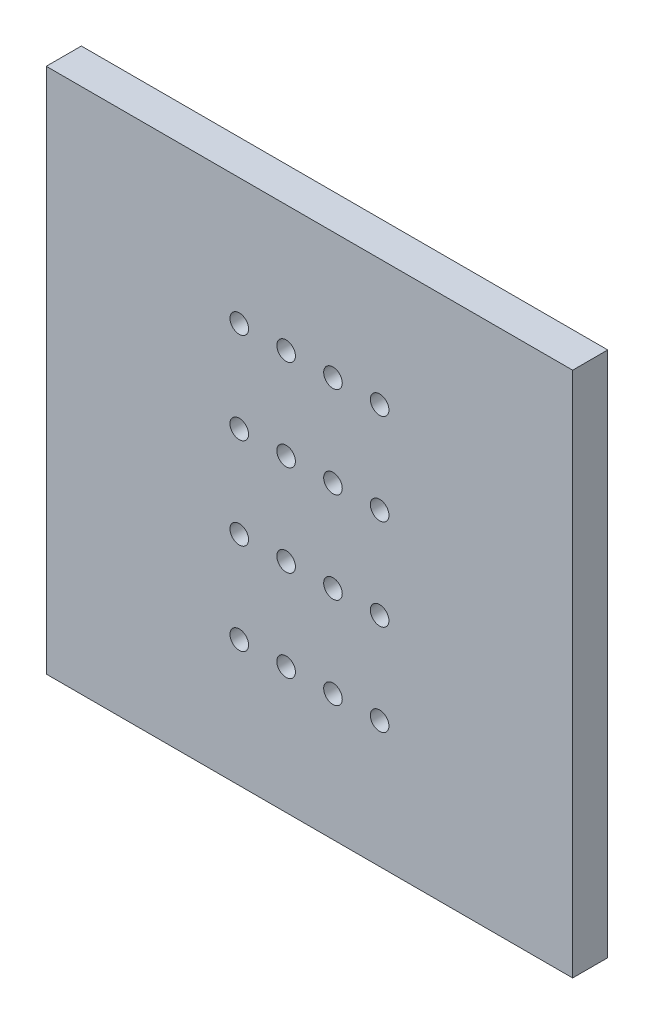
ISO-10303-21;
HEADER;
FILE_DESCRIPTION(('STEP AP214'),'2;1');
FILE_NAME('part.step','',(''),(''),'','','');
FILE_SCHEMA(('AUTOMOTIVE_DESIGN { 1 0 10303 214 1 1 1 1 }'));
ENDSEC;
DATA;
#1=APPLICATION_CONTEXT('core data for automotive mechanical design processes');
#2=APPLICATION_PROTOCOL_DEFINITION('international standard','automotive_design',2000,#1);
#3=PRODUCT_CONTEXT('',#1,'mechanical');
#4=PRODUCT('Part','Part','',(#3));
#5=PRODUCT_RELATED_PRODUCT_CATEGORY('part','',(#4));
#6=PRODUCT_DEFINITION_FORMATION('','',#4);
#7=PRODUCT_DEFINITION_CONTEXT('part definition',#1,'design');
#8=PRODUCT_DEFINITION('design','',#6,#7);
#9=PRODUCT_DEFINITION_SHAPE('','',#8);
#10=(LENGTH_UNIT() NAMED_UNIT(*) SI_UNIT(.MILLI.,.METRE.));
#11=(NAMED_UNIT(*) PLANE_ANGLE_UNIT() SI_UNIT($,.RADIAN.));
#12=(NAMED_UNIT(*) SI_UNIT($,.STERADIAN.) SOLID_ANGLE_UNIT());
#13=UNCERTAINTY_MEASURE_WITH_UNIT(LENGTH_MEASURE(1.E-05),#10,'distance_accuracy_value','');
#14=(GEOMETRIC_REPRESENTATION_CONTEXT(3) GLOBAL_UNCERTAINTY_ASSIGNED_CONTEXT((#13)) GLOBAL_UNIT_ASSIGNED_CONTEXT((#10,
#11,#12)) REPRESENTATION_CONTEXT('',''));
#15=CARTESIAN_POINT('',(0.,0.,0.));
#16=DIRECTION('',(0.,0.,1.));
#17=DIRECTION('',(1.,0.,0.));
#18=AXIS2_PLACEMENT_3D('',#15,#16,#17);
#19=CARTESIAN_POINT('',(15.,-15.,2.));
#20=DIRECTION('',(-1.,0.,0.));
#21=DIRECTION('',(0.,0.,1.));
#22=AXIS2_PLACEMENT_3D('',#19,#20,#21);
#23=PLANE('',#22);
#24=DIRECTION('',(0.,1.,0.));
#25=VECTOR('',#24,1.);
#26=CARTESIAN_POINT('',(15.,-15.,0.));
#27=LINE('',#26,#25);
#28=CARTESIAN_POINT('',(15.,-15.,0.));
#29=VERTEX_POINT('',#28);
#30=CARTESIAN_POINT('',(15.,15.,0.));
#31=VERTEX_POINT('',#30);
#32=EDGE_CURVE('E103',#29,#31,#27,.T.);
#33=ORIENTED_EDGE('',*,*,#32,.T.);
#34=DIRECTION('',(0.,0.,-1.));
#35=VECTOR('',#34,1.);
#36=CARTESIAN_POINT('',(15.,15.,2.));
#37=LINE('',#36,#35);
#38=CARTESIAN_POINT('',(15.,15.,2.));
#39=VERTEX_POINT('',#38);
#40=EDGE_CURVE('E11',#39,#31,#37,.T.);
#41=ORIENTED_EDGE('',*,*,#40,.F.);
#42=DIRECTION('',(0.,1.,0.));
#43=VECTOR('',#42,1.);
#44=CARTESIAN_POINT('',(15.,-15.,2.));
#45=LINE('',#44,#43);
#46=CARTESIAN_POINT('',(15.,-15.,2.));
#47=VERTEX_POINT('',#46);
#48=EDGE_CURVE('E90',#47,#39,#45,.T.);
#49=ORIENTED_EDGE('',*,*,#48,.F.);
#50=DIRECTION('',(0.,0.,-1.));
#51=VECTOR('',#50,1.);
#52=CARTESIAN_POINT('',(15.,-15.,2.));
#53=LINE('',#52,#51);
#54=EDGE_CURVE('E99',#47,#29,#53,.T.);
#55=ORIENTED_EDGE('',*,*,#54,.T.);
#56=EDGE_LOOP('',(#33,#41,#49,#55));
#57=FACE_BOUND('',#56,.T.);
#58=ADVANCED_FACE('F37',(#57),#23,.F.);
#59=CARTESIAN_POINT('',(-15.,15.,2.));
#60=DIRECTION('',(0.,-1.,0.));
#61=DIRECTION('',(0.,0.,-1.));
#62=AXIS2_PLACEMENT_3D('',#59,#60,#61);
#63=PLANE('',#62);
#64=DIRECTION('',(-1.,0.,0.));
#65=VECTOR('',#64,1.);
#66=CARTESIAN_POINT('',(-15.,15.,0.));
#67=LINE('',#66,#65);
#68=CARTESIAN_POINT('',(-15.,15.,0.));
#69=VERTEX_POINT('',#68);
#70=EDGE_CURVE('E94',#31,#69,#67,.T.);
#71=ORIENTED_EDGE('',*,*,#70,.T.);
#72=DIRECTION('',(0.,0.,-1.));
#73=VECTOR('',#72,1.);
#74=CARTESIAN_POINT('',(-15.,15.,2.));
#75=LINE('',#74,#73);
#76=CARTESIAN_POINT('',(-15.,15.,2.));
#77=VERTEX_POINT('',#76);
#78=EDGE_CURVE('E46',#77,#69,#75,.T.);
#79=ORIENTED_EDGE('',*,*,#78,.F.);
#80=DIRECTION('',(-1.,0.,0.));
#81=VECTOR('',#80,1.);
#82=CARTESIAN_POINT('',(-15.,15.,2.));
#83=LINE('',#82,#81);
#84=EDGE_CURVE('E85',#39,#77,#83,.T.);
#85=ORIENTED_EDGE('',*,*,#84,.F.);
#86=ORIENTED_EDGE('',*,*,#40,.T.);
#87=EDGE_LOOP('',(#71,#79,#85,#86));
#88=FACE_BOUND('',#87,.T.);
#89=ADVANCED_FACE('F93',(#88),#63,.F.);
#90=CARTESIAN_POINT('',(-15.,-15.,2.));
#91=DIRECTION('',(1.,0.,0.));
#92=DIRECTION('',(0.,0.,-1.));
#93=AXIS2_PLACEMENT_3D('',#90,#91,#92);
#94=PLANE('',#93);
#95=DIRECTION('',(0.,-1.,0.));
#96=VECTOR('',#95,1.);
#97=CARTESIAN_POINT('',(-15.,-15.,0.));
#98=LINE('',#97,#96);
#99=CARTESIAN_POINT('',(-15.,-15.,0.));
#100=VERTEX_POINT('',#99);
#101=EDGE_CURVE('E72',#69,#100,#98,.T.);
#102=ORIENTED_EDGE('',*,*,#101,.T.);
#103=DIRECTION('',(0.,0.,-1.));
#104=VECTOR('',#103,1.);
#105=CARTESIAN_POINT('',(-15.,-15.,2.));
#106=LINE('',#105,#104);
#107=CARTESIAN_POINT('',(-15.,-15.,2.));
#108=VERTEX_POINT('',#107);
#109=EDGE_CURVE('E95',#108,#100,#106,.T.);
#110=ORIENTED_EDGE('',*,*,#109,.F.);
#111=DIRECTION('',(0.,-1.,0.));
#112=VECTOR('',#111,1.);
#113=CARTESIAN_POINT('',(-15.,-15.,2.));
#114=LINE('',#113,#112);
#115=EDGE_CURVE('E88',#77,#108,#114,.T.);
#116=ORIENTED_EDGE('',*,*,#115,.F.);
#117=ORIENTED_EDGE('',*,*,#78,.T.);
#118=EDGE_LOOP('',(#102,#110,#116,#117));
#119=FACE_BOUND('',#118,.T.);
#120=ADVANCED_FACE('F97',(#119),#94,.F.);
#121=CARTESIAN_POINT('',(-15.,-15.,2.));
#122=DIRECTION('',(0.,1.,0.));
#123=DIRECTION('',(0.,0.,1.));
#124=AXIS2_PLACEMENT_3D('',#121,#122,#123);
#125=PLANE('',#124);
#126=DIRECTION('',(1.,0.,0.));
#127=VECTOR('',#126,1.);
#128=CARTESIAN_POINT('',(-15.,-15.,0.));
#129=LINE('',#128,#127);
#130=EDGE_CURVE('E78',#100,#29,#129,.T.);
#131=ORIENTED_EDGE('',*,*,#130,.T.);
#132=ORIENTED_EDGE('',*,*,#54,.F.);
#133=DIRECTION('',(1.,0.,0.));
#134=VECTOR('',#133,1.);
#135=CARTESIAN_POINT('',(-15.,-15.,2.));
#136=LINE('',#135,#134);
#137=EDGE_CURVE('E55',#108,#47,#136,.T.);
#138=ORIENTED_EDGE('',*,*,#137,.F.);
#139=ORIENTED_EDGE('',*,*,#109,.T.);
#140=EDGE_LOOP('',(#131,#132,#138,#139));
#141=FACE_BOUND('',#140,.T.);
#142=ADVANCED_FACE('F199',(#141),#125,.F.);
#143=CARTESIAN_POINT('',(0.,0.,2.));
#144=DIRECTION('',(0.,0.,-1.));
#145=DIRECTION('',(-1.,0.,0.));
#146=AXIS2_PLACEMENT_3D('',#143,#144,#145);
#147=PLANE('',#146);
#148=CARTESIAN_POINT('',(-1.33,-2.6,2.));
#149=DIRECTION('',(0.,0.,1.));
#150=DIRECTION('',(1.,0.,0.));
#151=AXIS2_PLACEMENT_3D('',#148,#149,#150);
#152=CIRCLE('',#151,0.53);
#153=CARTESIAN_POINT('',(-0.8,-2.6,2.));
#154=VERTEX_POINT('',#153);
#155=EDGE_CURVE('E450',#154,#154,#152,.T.);
#156=ORIENTED_EDGE('',*,*,#155,.F.);
#157=EDGE_LOOP('',(#156));
#158=FACE_BOUND('',#157,.T.);
#159=CARTESIAN_POINT('',(-1.33,2.6,2.));
#160=DIRECTION('',(0.,0.,1.));
#161=DIRECTION('',(1.,0.,0.));
#162=AXIS2_PLACEMENT_3D('',#159,#160,#161);
#163=CIRCLE('',#162,0.53);
#164=CARTESIAN_POINT('',(-0.8,2.6,2.));
#165=VERTEX_POINT('',#164);
#166=EDGE_CURVE('E448',#165,#165,#163,.T.);
#167=ORIENTED_EDGE('',*,*,#166,.F.);
#168=EDGE_LOOP('',(#167));
#169=FACE_BOUND('',#168,.T.);
#170=CARTESIAN_POINT('',(-1.33,7.8,2.));
#171=DIRECTION('',(0.,0.,1.));
#172=DIRECTION('',(1.,0.,0.));
#173=AXIS2_PLACEMENT_3D('',#170,#171,#172);
#174=CIRCLE('',#173,0.53);
#175=CARTESIAN_POINT('',(-0.8,7.8,2.));
#176=VERTEX_POINT('',#175);
#177=EDGE_CURVE('E451',#176,#176,#174,.T.);
#178=ORIENTED_EDGE('',*,*,#177,.F.);
#179=EDGE_LOOP('',(#178));
#180=FACE_BOUND('',#179,.T.);
#181=CARTESIAN_POINT('',(1.34,-7.8,2.));
#182=DIRECTION('',(0.,0.,1.));
#183=DIRECTION('',(1.,0.,0.));
#184=AXIS2_PLACEMENT_3D('',#181,#182,#183);
#185=CIRCLE('',#184,0.53);
#186=CARTESIAN_POINT('',(1.87,-7.8,2.));
#187=VERTEX_POINT('',#186);
#188=EDGE_CURVE('E457',#187,#187,#185,.T.);
#189=ORIENTED_EDGE('',*,*,#188,.F.);
#190=EDGE_LOOP('',(#189));
#191=FACE_BOUND('',#190,.T.);
#192=CARTESIAN_POINT('',(-4.,-2.6,2.));
#193=DIRECTION('',(0.,0.,1.));
#194=DIRECTION('',(1.,0.,0.));
#195=AXIS2_PLACEMENT_3D('',#192,#193,#194);
#196=CIRCLE('',#195,0.53);
#197=CARTESIAN_POINT('',(-3.47,-2.6,2.));
#198=VERTEX_POINT('',#197);
#199=EDGE_CURVE('E467',#198,#198,#196,.T.);
#200=ORIENTED_EDGE('',*,*,#199,.F.);
#201=EDGE_LOOP('',(#200));
#202=FACE_BOUND('',#201,.T.);
#203=CARTESIAN_POINT('',(-4.,2.6,2.));
#204=DIRECTION('',(0.,0.,1.));
#205=DIRECTION('',(1.,0.,0.));
#206=AXIS2_PLACEMENT_3D('',#203,#204,#205);
#207=CIRCLE('',#206,0.53);
#208=CARTESIAN_POINT('',(-3.47,2.6,2.));
#209=VERTEX_POINT('',#208);
#210=EDGE_CURVE('E464',#209,#209,#207,.T.);
#211=ORIENTED_EDGE('',*,*,#210,.F.);
#212=EDGE_LOOP('',(#211));
#213=FACE_BOUND('',#212,.T.);
#214=CARTESIAN_POINT('',(-4.,7.8,2.));
#215=DIRECTION('',(0.,0.,1.));
#216=DIRECTION('',(1.,0.,0.));
#217=AXIS2_PLACEMENT_3D('',#214,#215,#216);
#218=CIRCLE('',#217,0.53);
#219=CARTESIAN_POINT('',(-3.47,7.8,2.));
#220=VERTEX_POINT('',#219);
#221=EDGE_CURVE('E461',#220,#220,#218,.T.);
#222=ORIENTED_EDGE('',*,*,#221,.F.);
#223=EDGE_LOOP('',(#222));
#224=FACE_BOUND('',#223,.T.);
#225=CARTESIAN_POINT('',(-1.33,-7.8,2.));
#226=DIRECTION('',(0.,0.,1.));
#227=DIRECTION('',(1.,0.,0.));
#228=AXIS2_PLACEMENT_3D('',#225,#226,#227);
#229=CIRCLE('',#228,0.53);
#230=CARTESIAN_POINT('',(-0.8,-7.8,2.));
#231=VERTEX_POINT('',#230);
#232=EDGE_CURVE('E454',#231,#231,#229,.T.);
#233=ORIENTED_EDGE('',*,*,#232,.F.);
#234=EDGE_LOOP('',(#233));
#235=FACE_BOUND('',#234,.T.);
#236=CARTESIAN_POINT('',(4.,7.8,2.));
#237=DIRECTION('',(0.,0.,1.));
#238=DIRECTION('',(1.,0.,0.));
#239=AXIS2_PLACEMENT_3D('',#236,#237,#238);
#240=CIRCLE('',#239,0.53);
#241=CARTESIAN_POINT('',(4.53,7.8,2.));
#242=VERTEX_POINT('',#241);
#243=EDGE_CURVE('E487',#242,#242,#240,.T.);
#244=ORIENTED_EDGE('',*,*,#243,.F.);
#245=EDGE_LOOP('',(#244));
#246=FACE_BOUND('',#245,.T.);
#247=CARTESIAN_POINT('',(4.,2.6,2.));
#248=DIRECTION('',(0.,0.,1.));
#249=DIRECTION('',(1.,0.,0.));
#250=AXIS2_PLACEMENT_3D('',#247,#248,#249);
#251=CIRCLE('',#250,0.53);
#252=CARTESIAN_POINT('',(4.53,2.6,2.));
#253=VERTEX_POINT('',#252);
#254=EDGE_CURVE('E491',#253,#253,#251,.T.);
#255=ORIENTED_EDGE('',*,*,#254,.F.);
#256=EDGE_LOOP('',(#255));
#257=FACE_BOUND('',#256,.T.);
#258=CARTESIAN_POINT('',(4.,-2.6,2.));
#259=DIRECTION('',(0.,0.,1.));
#260=DIRECTION('',(1.,0.,0.));
#261=AXIS2_PLACEMENT_3D('',#258,#259,#260);
#262=CIRCLE('',#261,0.53);
#263=CARTESIAN_POINT('',(4.53,-2.6,2.));
#264=VERTEX_POINT('',#263);
#265=EDGE_CURVE('E495',#264,#264,#262,.T.);
#266=ORIENTED_EDGE('',*,*,#265,.F.);
#267=EDGE_LOOP('',(#266));
#268=FACE_BOUND('',#267,.T.);
#269=CARTESIAN_POINT('',(1.34,-2.6,2.));
#270=DIRECTION('',(0.,0.,1.));
#271=DIRECTION('',(1.,0.,0.));
#272=AXIS2_PLACEMENT_3D('',#269,#270,#271);
#273=CIRCLE('',#272,0.53);
#274=CARTESIAN_POINT('',(1.87,-2.6,2.));
#275=VERTEX_POINT('',#274);
#276=EDGE_CURVE('E499',#275,#275,#273,.T.);
#277=ORIENTED_EDGE('',*,*,#276,.F.);
#278=EDGE_LOOP('',(#277));
#279=FACE_BOUND('',#278,.T.);
#280=CARTESIAN_POINT('',(1.34,2.6,2.));
#281=DIRECTION('',(0.,0.,1.));
#282=DIRECTION('',(1.,0.,0.));
#283=AXIS2_PLACEMENT_3D('',#280,#281,#282);
#284=CIRCLE('',#283,0.53);
#285=CARTESIAN_POINT('',(1.87,2.6,2.));
#286=VERTEX_POINT('',#285);
#287=EDGE_CURVE('E503',#286,#286,#284,.T.);
#288=ORIENTED_EDGE('',*,*,#287,.F.);
#289=EDGE_LOOP('',(#288));
#290=FACE_BOUND('',#289,.T.);
#291=CARTESIAN_POINT('',(1.34,7.8,2.));
#292=DIRECTION('',(0.,0.,1.));
#293=DIRECTION('',(1.,0.,0.));
#294=AXIS2_PLACEMENT_3D('',#291,#292,#293);
#295=CIRCLE('',#294,0.53);
#296=CARTESIAN_POINT('',(1.87,7.8,2.));
#297=VERTEX_POINT('',#296);
#298=EDGE_CURVE('E507',#297,#297,#295,.T.);
#299=ORIENTED_EDGE('',*,*,#298,.F.);
#300=EDGE_LOOP('',(#299));
#301=FACE_BOUND('',#300,.T.);
#302=CARTESIAN_POINT('',(4.,-7.8,2.));
#303=DIRECTION('',(0.,0.,1.));
#304=DIRECTION('',(1.,0.,0.));
#305=AXIS2_PLACEMENT_3D('',#302,#303,#304);
#306=CIRCLE('',#305,0.53);
#307=CARTESIAN_POINT('',(4.53,-7.8,2.));
#308=VERTEX_POINT('',#307);
#309=EDGE_CURVE('E510',#308,#308,#306,.T.);
#310=ORIENTED_EDGE('',*,*,#309,.F.);
#311=EDGE_LOOP('',(#310));
#312=FACE_BOUND('',#311,.T.);
#313=CARTESIAN_POINT('',(-4.,-7.8,2.));
#314=DIRECTION('',(0.,0.,1.));
#315=DIRECTION('',(1.,0.,0.));
#316=AXIS2_PLACEMENT_3D('',#313,#314,#315);
#317=CIRCLE('',#316,0.53);
#318=CARTESIAN_POINT('',(-3.47,-7.8,2.));
#319=VERTEX_POINT('',#318);
#320=EDGE_CURVE('E115',#319,#319,#317,.T.);
#321=ORIENTED_EDGE('',*,*,#320,.F.);
#322=EDGE_LOOP('',(#321));
#323=FACE_BOUND('',#322,.T.);
#324=ORIENTED_EDGE('',*,*,#48,.T.);
#325=ORIENTED_EDGE('',*,*,#84,.T.);
#326=ORIENTED_EDGE('',*,*,#115,.T.);
#327=ORIENTED_EDGE('',*,*,#137,.T.);
#328=EDGE_LOOP('',(#324,#325,#326,#327));
#329=FACE_BOUND('',#328,.T.);
#330=ADVANCED_FACE('F86',(#158,#169,#180,#191,#202,#213,#224,#235,#246,#257,#268,#279,#290,#301,
#312,#323,#329),#147,.F.);
#331=CARTESIAN_POINT('',(0.,0.,0.));
#332=DIRECTION('',(0.,0.,-1.));
#333=DIRECTION('',(-1.,0.,0.));
#334=AXIS2_PLACEMENT_3D('',#331,#332,#333);
#335=PLANE('',#334);
#336=CARTESIAN_POINT('',(-1.33,-2.6,0.));
#337=DIRECTION('',(0.,0.,-1.));
#338=DIRECTION('',(-1.,0.,0.));
#339=AXIS2_PLACEMENT_3D('',#336,#337,#338);
#340=CIRCLE('',#339,0.53);
#341=CARTESIAN_POINT('',(-1.86,-2.6,0.));
#342=VERTEX_POINT('',#341);
#343=EDGE_CURVE('E40',#342,#342,#340,.T.);
#344=ORIENTED_EDGE('',*,*,#343,.F.);
#345=EDGE_LOOP('',(#344));
#346=FACE_BOUND('',#345,.T.);
#347=CARTESIAN_POINT('',(-1.33,2.6,0.));
#348=DIRECTION('',(0.,0.,-1.));
#349=DIRECTION('',(-1.,0.,0.));
#350=AXIS2_PLACEMENT_3D('',#347,#348,#349);
#351=CIRCLE('',#350,0.53);
#352=CARTESIAN_POINT('',(-1.86,2.6,0.));
#353=VERTEX_POINT('',#352);
#354=EDGE_CURVE('E153',#353,#353,#351,.T.);
#355=ORIENTED_EDGE('',*,*,#354,.F.);
#356=EDGE_LOOP('',(#355));
#357=FACE_BOUND('',#356,.T.);
#358=CARTESIAN_POINT('',(-1.33,7.8,0.));
#359=DIRECTION('',(0.,0.,-1.));
#360=DIRECTION('',(-1.,0.,0.));
#361=AXIS2_PLACEMENT_3D('',#358,#359,#360);
#362=CIRCLE('',#361,0.53);
#363=CARTESIAN_POINT('',(-1.86,7.8,0.));
#364=VERTEX_POINT('',#363);
#365=EDGE_CURVE('E151',#364,#364,#362,.T.);
#366=ORIENTED_EDGE('',*,*,#365,.F.);
#367=EDGE_LOOP('',(#366));
#368=FACE_BOUND('',#367,.T.);
#369=CARTESIAN_POINT('',(1.34,-7.8,0.));
#370=DIRECTION('',(0.,0.,-1.));
#371=DIRECTION('',(-1.,0.,0.));
#372=AXIS2_PLACEMENT_3D('',#369,#370,#371);
#373=CIRCLE('',#372,0.53);
#374=CARTESIAN_POINT('',(0.81,-7.8,0.));
#375=VERTEX_POINT('',#374);
#376=EDGE_CURVE('E148',#375,#375,#373,.T.);
#377=ORIENTED_EDGE('',*,*,#376,.F.);
#378=EDGE_LOOP('',(#377));
#379=FACE_BOUND('',#378,.T.);
#380=CARTESIAN_POINT('',(-4.,-2.6,0.));
#381=DIRECTION('',(0.,0.,-1.));
#382=DIRECTION('',(-1.,0.,0.));
#383=AXIS2_PLACEMENT_3D('',#380,#381,#382);
#384=CIRCLE('',#383,0.53);
#385=CARTESIAN_POINT('',(-4.53,-2.6,0.));
#386=VERTEX_POINT('',#385);
#387=EDGE_CURVE('E145',#386,#386,#384,.T.);
#388=ORIENTED_EDGE('',*,*,#387,.F.);
#389=EDGE_LOOP('',(#388));
#390=FACE_BOUND('',#389,.T.);
#391=CARTESIAN_POINT('',(-4.,2.6,0.));
#392=DIRECTION('',(0.,0.,-1.));
#393=DIRECTION('',(-1.,0.,0.));
#394=AXIS2_PLACEMENT_3D('',#391,#392,#393);
#395=CIRCLE('',#394,0.53);
#396=CARTESIAN_POINT('',(-4.53,2.6,0.));
#397=VERTEX_POINT('',#396);
#398=EDGE_CURVE('E142',#397,#397,#395,.T.);
#399=ORIENTED_EDGE('',*,*,#398,.F.);
#400=EDGE_LOOP('',(#399));
#401=FACE_BOUND('',#400,.T.);
#402=CARTESIAN_POINT('',(-4.,7.8,0.));
#403=DIRECTION('',(0.,0.,-1.));
#404=DIRECTION('',(-1.,0.,0.));
#405=AXIS2_PLACEMENT_3D('',#402,#403,#404);
#406=CIRCLE('',#405,0.53);
#407=CARTESIAN_POINT('',(-4.53,7.8,0.));
#408=VERTEX_POINT('',#407);
#409=EDGE_CURVE('E139',#408,#408,#406,.T.);
#410=ORIENTED_EDGE('',*,*,#409,.F.);
#411=EDGE_LOOP('',(#410));
#412=FACE_BOUND('',#411,.T.);
#413=CARTESIAN_POINT('',(-1.33,-7.8,0.));
#414=DIRECTION('',(0.,0.,-1.));
#415=DIRECTION('',(-1.,0.,0.));
#416=AXIS2_PLACEMENT_3D('',#413,#414,#415);
#417=CIRCLE('',#416,0.53);
#418=CARTESIAN_POINT('',(-1.86,-7.8,0.));
#419=VERTEX_POINT('',#418);
#420=EDGE_CURVE('E136',#419,#419,#417,.T.);
#421=ORIENTED_EDGE('',*,*,#420,.F.);
#422=EDGE_LOOP('',(#421));
#423=FACE_BOUND('',#422,.T.);
#424=CARTESIAN_POINT('',(4.,7.8,0.));
#425=DIRECTION('',(0.,0.,-1.));
#426=DIRECTION('',(-1.,0.,0.));
#427=AXIS2_PLACEMENT_3D('',#424,#425,#426);
#428=CIRCLE('',#427,0.53);
#429=CARTESIAN_POINT('',(3.47,7.8,0.));
#430=VERTEX_POINT('',#429);
#431=EDGE_CURVE('E133',#430,#430,#428,.T.);
#432=ORIENTED_EDGE('',*,*,#431,.F.);
#433=EDGE_LOOP('',(#432));
#434=FACE_BOUND('',#433,.T.);
#435=CARTESIAN_POINT('',(4.,2.6,0.));
#436=DIRECTION('',(0.,0.,-1.));
#437=DIRECTION('',(-1.,0.,0.));
#438=AXIS2_PLACEMENT_3D('',#435,#436,#437);
#439=CIRCLE('',#438,0.53);
#440=CARTESIAN_POINT('',(3.47,2.6,0.));
#441=VERTEX_POINT('',#440);
#442=EDGE_CURVE('E130',#441,#441,#439,.T.);
#443=ORIENTED_EDGE('',*,*,#442,.F.);
#444=EDGE_LOOP('',(#443));
#445=FACE_BOUND('',#444,.T.);
#446=CARTESIAN_POINT('',(4.,-2.6,0.));
#447=DIRECTION('',(0.,0.,-1.));
#448=DIRECTION('',(-1.,0.,0.));
#449=AXIS2_PLACEMENT_3D('',#446,#447,#448);
#450=CIRCLE('',#449,0.53);
#451=CARTESIAN_POINT('',(3.47,-2.6,0.));
#452=VERTEX_POINT('',#451);
#453=EDGE_CURVE('E127',#452,#452,#450,.T.);
#454=ORIENTED_EDGE('',*,*,#453,.F.);
#455=EDGE_LOOP('',(#454));
#456=FACE_BOUND('',#455,.T.);
#457=CARTESIAN_POINT('',(1.34,-2.6,0.));
#458=DIRECTION('',(0.,0.,-1.));
#459=DIRECTION('',(-1.,0.,0.));
#460=AXIS2_PLACEMENT_3D('',#457,#458,#459);
#461=CIRCLE('',#460,0.53);
#462=CARTESIAN_POINT('',(0.81,-2.6,0.));
#463=VERTEX_POINT('',#462);
#464=EDGE_CURVE('E124',#463,#463,#461,.T.);
#465=ORIENTED_EDGE('',*,*,#464,.F.);
#466=EDGE_LOOP('',(#465));
#467=FACE_BOUND('',#466,.T.);
#468=CARTESIAN_POINT('',(1.34,2.6,0.));
#469=DIRECTION('',(0.,0.,-1.));
#470=DIRECTION('',(-1.,0.,0.));
#471=AXIS2_PLACEMENT_3D('',#468,#469,#470);
#472=CIRCLE('',#471,0.53);
#473=CARTESIAN_POINT('',(0.81,2.6,0.));
#474=VERTEX_POINT('',#473);
#475=EDGE_CURVE('E121',#474,#474,#472,.T.);
#476=ORIENTED_EDGE('',*,*,#475,.F.);
#477=EDGE_LOOP('',(#476));
#478=FACE_BOUND('',#477,.T.);
#479=CARTESIAN_POINT('',(1.34,7.8,0.));
#480=DIRECTION('',(0.,0.,-1.));
#481=DIRECTION('',(-1.,0.,0.));
#482=AXIS2_PLACEMENT_3D('',#479,#480,#481);
#483=CIRCLE('',#482,0.53);
#484=CARTESIAN_POINT('',(0.81,7.8,0.));
#485=VERTEX_POINT('',#484);
#486=EDGE_CURVE('E118',#485,#485,#483,.T.);
#487=ORIENTED_EDGE('',*,*,#486,.F.);
#488=EDGE_LOOP('',(#487));
#489=FACE_BOUND('',#488,.T.);
#490=CARTESIAN_POINT('',(4.,-7.8,0.));
#491=DIRECTION('',(0.,0.,-1.));
#492=DIRECTION('',(-1.,0.,0.));
#493=AXIS2_PLACEMENT_3D('',#490,#491,#492);
#494=CIRCLE('',#493,0.53);
#495=CARTESIAN_POINT('',(3.47,-7.8,0.));
#496=VERTEX_POINT('',#495);
#497=EDGE_CURVE('E114',#496,#496,#494,.T.);
#498=ORIENTED_EDGE('',*,*,#497,.F.);
#499=EDGE_LOOP('',(#498));
#500=FACE_BOUND('',#499,.T.);
#501=CARTESIAN_POINT('',(-4.,-7.8,0.));
#502=DIRECTION('',(0.,0.,-1.));
#503=DIRECTION('',(-1.,0.,0.));
#504=AXIS2_PLACEMENT_3D('',#501,#502,#503);
#505=CIRCLE('',#504,0.53);
#506=CARTESIAN_POINT('',(-4.53,-7.8,0.));
#507=VERTEX_POINT('',#506);
#508=EDGE_CURVE('E111',#507,#507,#505,.T.);
#509=ORIENTED_EDGE('',*,*,#508,.F.);
#510=EDGE_LOOP('',(#509));
#511=FACE_BOUND('',#510,.T.);
#512=ORIENTED_EDGE('',*,*,#32,.F.);
#513=ORIENTED_EDGE('',*,*,#130,.F.);
#514=ORIENTED_EDGE('',*,*,#101,.F.);
#515=ORIENTED_EDGE('',*,*,#70,.F.);
#516=EDGE_LOOP('',(#512,#513,#514,#515));
#517=FACE_BOUND('',#516,.T.);
#518=ADVANCED_FACE('F163',(#346,#357,#368,#379,#390,#401,#412,#423,#434,#445,#456,#467,#478,
#489,#500,#511,#517),#335,.T.);
#519=CARTESIAN_POINT('',(-4.,-7.8,-8.));
#520=DIRECTION('',(0.,0.,1.));
#521=DIRECTION('',(1.,0.,0.));
#522=AXIS2_PLACEMENT_3D('',#519,#520,#521);
#523=CYLINDRICAL_SURFACE('',#522,0.53);
#524=ORIENTED_EDGE('',*,*,#508,.T.);
#525=EDGE_LOOP('',(#524));
#526=FACE_BOUND('',#525,.T.);
#527=ORIENTED_EDGE('',*,*,#320,.T.);
#528=EDGE_LOOP('',(#527));
#529=FACE_BOUND('',#528,.T.);
#530=ADVANCED_FACE('F166',(#526,#529),#523,.F.);
#531=CARTESIAN_POINT('',(4.,-7.8,-8.));
#532=DIRECTION('',(0.,0.,1.));
#533=DIRECTION('',(1.,0.,0.));
#534=AXIS2_PLACEMENT_3D('',#531,#532,#533);
#535=CYLINDRICAL_SURFACE('',#534,0.53);
#536=ORIENTED_EDGE('',*,*,#497,.T.);
#537=EDGE_LOOP('',(#536));
#538=FACE_BOUND('',#537,.T.);
#539=ORIENTED_EDGE('',*,*,#309,.T.);
#540=EDGE_LOOP('',(#539));
#541=FACE_BOUND('',#540,.T.);
#542=ADVANCED_FACE('F248',(#538,#541),#535,.F.);
#543=CARTESIAN_POINT('',(1.34,7.8,-8.));
#544=DIRECTION('',(0.,0.,1.));
#545=DIRECTION('',(1.,0.,0.));
#546=AXIS2_PLACEMENT_3D('',#543,#544,#545);
#547=CYLINDRICAL_SURFACE('',#546,0.53);
#548=ORIENTED_EDGE('',*,*,#486,.T.);
#549=EDGE_LOOP('',(#548));
#550=FACE_BOUND('',#549,.T.);
#551=ORIENTED_EDGE('',*,*,#298,.T.);
#552=EDGE_LOOP('',(#551));
#553=FACE_BOUND('',#552,.T.);
#554=ADVANCED_FACE('F259',(#550,#553),#547,.F.);
#555=CARTESIAN_POINT('',(1.34,2.6,-8.));
#556=DIRECTION('',(0.,0.,1.));
#557=DIRECTION('',(1.,0.,0.));
#558=AXIS2_PLACEMENT_3D('',#555,#556,#557);
#559=CYLINDRICAL_SURFACE('',#558,0.53);
#560=ORIENTED_EDGE('',*,*,#475,.T.);
#561=EDGE_LOOP('',(#560));
#562=FACE_BOUND('',#561,.T.);
#563=ORIENTED_EDGE('',*,*,#287,.T.);
#564=EDGE_LOOP('',(#563));
#565=FACE_BOUND('',#564,.T.);
#566=ADVANCED_FACE('F270',(#562,#565),#559,.F.);
#567=CARTESIAN_POINT('',(1.34,-2.6,-8.));
#568=DIRECTION('',(0.,0.,1.));
#569=DIRECTION('',(1.,0.,0.));
#570=AXIS2_PLACEMENT_3D('',#567,#568,#569);
#571=CYLINDRICAL_SURFACE('',#570,0.53);
#572=ORIENTED_EDGE('',*,*,#464,.T.);
#573=EDGE_LOOP('',(#572));
#574=FACE_BOUND('',#573,.T.);
#575=ORIENTED_EDGE('',*,*,#276,.T.);
#576=EDGE_LOOP('',(#575));
#577=FACE_BOUND('',#576,.T.);
#578=ADVANCED_FACE('F281',(#574,#577),#571,.F.);
#579=CARTESIAN_POINT('',(4.,-2.6,-8.));
#580=DIRECTION('',(0.,0.,1.));
#581=DIRECTION('',(1.,0.,0.));
#582=AXIS2_PLACEMENT_3D('',#579,#580,#581);
#583=CYLINDRICAL_SURFACE('',#582,0.53);
#584=ORIENTED_EDGE('',*,*,#453,.T.);
#585=EDGE_LOOP('',(#584));
#586=FACE_BOUND('',#585,.T.);
#587=ORIENTED_EDGE('',*,*,#265,.T.);
#588=EDGE_LOOP('',(#587));
#589=FACE_BOUND('',#588,.T.);
#590=ADVANCED_FACE('F292',(#586,#589),#583,.F.);
#591=CARTESIAN_POINT('',(4.,2.6,-8.));
#592=DIRECTION('',(0.,0.,1.));
#593=DIRECTION('',(1.,0.,0.));
#594=AXIS2_PLACEMENT_3D('',#591,#592,#593);
#595=CYLINDRICAL_SURFACE('',#594,0.53);
#596=ORIENTED_EDGE('',*,*,#442,.T.);
#597=EDGE_LOOP('',(#596));
#598=FACE_BOUND('',#597,.T.);
#599=ORIENTED_EDGE('',*,*,#254,.T.);
#600=EDGE_LOOP('',(#599));
#601=FACE_BOUND('',#600,.T.);
#602=ADVANCED_FACE('F303',(#598,#601),#595,.F.);
#603=CARTESIAN_POINT('',(4.,7.8,-8.));
#604=DIRECTION('',(0.,0.,1.));
#605=DIRECTION('',(1.,0.,0.));
#606=AXIS2_PLACEMENT_3D('',#603,#604,#605);
#607=CYLINDRICAL_SURFACE('',#606,0.53);
#608=ORIENTED_EDGE('',*,*,#431,.T.);
#609=EDGE_LOOP('',(#608));
#610=FACE_BOUND('',#609,.T.);
#611=ORIENTED_EDGE('',*,*,#243,.T.);
#612=EDGE_LOOP('',(#611));
#613=FACE_BOUND('',#612,.T.);
#614=ADVANCED_FACE('F314',(#610,#613),#607,.F.);
#615=CARTESIAN_POINT('',(-1.33,-7.8,-8.));
#616=DIRECTION('',(0.,0.,1.));
#617=DIRECTION('',(1.,0.,0.));
#618=AXIS2_PLACEMENT_3D('',#615,#616,#617);
#619=CYLINDRICAL_SURFACE('',#618,0.53);
#620=ORIENTED_EDGE('',*,*,#420,.T.);
#621=EDGE_LOOP('',(#620));
#622=FACE_BOUND('',#621,.T.);
#623=ORIENTED_EDGE('',*,*,#232,.T.);
#624=EDGE_LOOP('',(#623));
#625=FACE_BOUND('',#624,.T.);
#626=ADVANCED_FACE('F325',(#622,#625),#619,.F.);
#627=CARTESIAN_POINT('',(-4.,7.8,-8.));
#628=DIRECTION('',(0.,0.,1.));
#629=DIRECTION('',(1.,0.,0.));
#630=AXIS2_PLACEMENT_3D('',#627,#628,#629);
#631=CYLINDRICAL_SURFACE('',#630,0.53);
#632=ORIENTED_EDGE('',*,*,#409,.T.);
#633=EDGE_LOOP('',(#632));
#634=FACE_BOUND('',#633,.T.);
#635=ORIENTED_EDGE('',*,*,#221,.T.);
#636=EDGE_LOOP('',(#635));
#637=FACE_BOUND('',#636,.T.);
#638=ADVANCED_FACE('F336',(#634,#637),#631,.F.);
#639=CARTESIAN_POINT('',(-4.,2.6,-8.));
#640=DIRECTION('',(0.,0.,1.));
#641=DIRECTION('',(1.,0.,0.));
#642=AXIS2_PLACEMENT_3D('',#639,#640,#641);
#643=CYLINDRICAL_SURFACE('',#642,0.53);
#644=ORIENTED_EDGE('',*,*,#398,.T.);
#645=EDGE_LOOP('',(#644));
#646=FACE_BOUND('',#645,.T.);
#647=ORIENTED_EDGE('',*,*,#210,.T.);
#648=EDGE_LOOP('',(#647));
#649=FACE_BOUND('',#648,.T.);
#650=ADVANCED_FACE('F347',(#646,#649),#643,.F.);
#651=CARTESIAN_POINT('',(-4.,-2.6,-8.));
#652=DIRECTION('',(0.,0.,1.));
#653=DIRECTION('',(1.,0.,0.));
#654=AXIS2_PLACEMENT_3D('',#651,#652,#653);
#655=CYLINDRICAL_SURFACE('',#654,0.53);
#656=ORIENTED_EDGE('',*,*,#387,.T.);
#657=EDGE_LOOP('',(#656));
#658=FACE_BOUND('',#657,.T.);
#659=ORIENTED_EDGE('',*,*,#199,.T.);
#660=EDGE_LOOP('',(#659));
#661=FACE_BOUND('',#660,.T.);
#662=ADVANCED_FACE('F358',(#658,#661),#655,.F.);
#663=CARTESIAN_POINT('',(1.34,-7.8,-8.));
#664=DIRECTION('',(0.,0.,1.));
#665=DIRECTION('',(1.,0.,0.));
#666=AXIS2_PLACEMENT_3D('',#663,#664,#665);
#667=CYLINDRICAL_SURFACE('',#666,0.53);
#668=ORIENTED_EDGE('',*,*,#376,.T.);
#669=EDGE_LOOP('',(#668));
#670=FACE_BOUND('',#669,.T.);
#671=ORIENTED_EDGE('',*,*,#188,.T.);
#672=EDGE_LOOP('',(#671));
#673=FACE_BOUND('',#672,.T.);
#674=ADVANCED_FACE('F369',(#670,#673),#667,.F.);
#675=CARTESIAN_POINT('',(-1.33,7.8,-8.));
#676=DIRECTION('',(0.,0.,1.));
#677=DIRECTION('',(1.,0.,0.));
#678=AXIS2_PLACEMENT_3D('',#675,#676,#677);
#679=CYLINDRICAL_SURFACE('',#678,0.53);
#680=ORIENTED_EDGE('',*,*,#365,.T.);
#681=EDGE_LOOP('',(#680));
#682=FACE_BOUND('',#681,.T.);
#683=ORIENTED_EDGE('',*,*,#177,.T.);
#684=EDGE_LOOP('',(#683));
#685=FACE_BOUND('',#684,.T.);
#686=ADVANCED_FACE('F380',(#682,#685),#679,.F.);
#687=CARTESIAN_POINT('',(-1.33,2.6,-8.));
#688=DIRECTION('',(0.,0.,1.));
#689=DIRECTION('',(1.,0.,0.));
#690=AXIS2_PLACEMENT_3D('',#687,#688,#689);
#691=CYLINDRICAL_SURFACE('',#690,0.53);
#692=ORIENTED_EDGE('',*,*,#354,.T.);
#693=EDGE_LOOP('',(#692));
#694=FACE_BOUND('',#693,.T.);
#695=ORIENTED_EDGE('',*,*,#166,.T.);
#696=EDGE_LOOP('',(#695));
#697=FACE_BOUND('',#696,.T.);
#698=ADVANCED_FACE('F391',(#694,#697),#691,.F.);
#699=CARTESIAN_POINT('',(-1.33,-2.6,-8.));
#700=DIRECTION('',(0.,0.,1.));
#701=DIRECTION('',(1.,0.,0.));
#702=AXIS2_PLACEMENT_3D('',#699,#700,#701);
#703=CYLINDRICAL_SURFACE('',#702,0.53);
#704=ORIENTED_EDGE('',*,*,#343,.T.);
#705=EDGE_LOOP('',(#704));
#706=FACE_BOUND('',#705,.T.);
#707=ORIENTED_EDGE('',*,*,#155,.T.);
#708=EDGE_LOOP('',(#707));
#709=FACE_BOUND('',#708,.T.);
#710=ADVANCED_FACE('F160',(#706,#709),#703,.F.);
#711=CLOSED_SHELL('',(#58,#89,#120,#142,#330,#518,#530,#542,#554,#566,#578,#590,#602,#614,#626,
#638,#650,#662,#674,#686,#698,#710));
#712=MANIFOLD_SOLID_BREP('B2',#711);
#713=ADVANCED_BREP_SHAPE_REPRESENTATION('',(#18,#712),#14);
#714=SHAPE_DEFINITION_REPRESENTATION(#9,#713);
ENDSEC;
END-ISO-10303-21;
